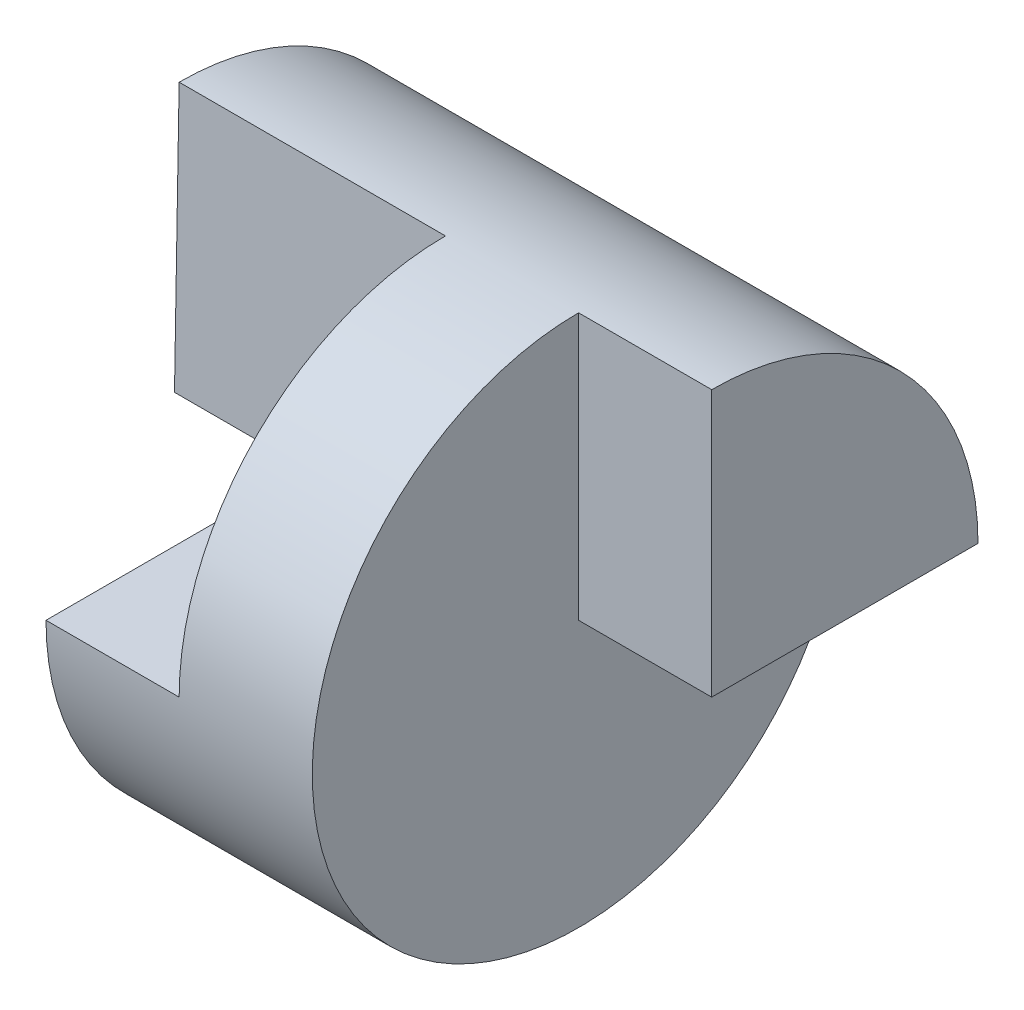
ISO-10303-21;
HEADER;
FILE_DESCRIPTION(('STEP AP214'),'2;1');
FILE_NAME('part.step','',(''),(''),'','','');
FILE_SCHEMA(('AUTOMOTIVE_DESIGN { 1 0 10303 214 1 1 1 1 }'));
ENDSEC;
DATA;
#1=APPLICATION_CONTEXT('core data for automotive mechanical design processes');
#2=APPLICATION_PROTOCOL_DEFINITION('international standard','automotive_design',2000,#1);
#3=PRODUCT_CONTEXT('',#1,'mechanical');
#4=PRODUCT('Part','Part','',(#3));
#5=PRODUCT_RELATED_PRODUCT_CATEGORY('part','',(#4));
#6=PRODUCT_DEFINITION_FORMATION('','',#4);
#7=PRODUCT_DEFINITION_CONTEXT('part definition',#1,'design');
#8=PRODUCT_DEFINITION('design','',#6,#7);
#9=PRODUCT_DEFINITION_SHAPE('','',#8);
#10=(LENGTH_UNIT() NAMED_UNIT(*) SI_UNIT(.MILLI.,.METRE.));
#11=(NAMED_UNIT(*) PLANE_ANGLE_UNIT() SI_UNIT($,.RADIAN.));
#12=(NAMED_UNIT(*) SI_UNIT($,.STERADIAN.) SOLID_ANGLE_UNIT());
#13=UNCERTAINTY_MEASURE_WITH_UNIT(LENGTH_MEASURE(1.E-05),#10,'distance_accuracy_value','');
#14=(GEOMETRIC_REPRESENTATION_CONTEXT(3) GLOBAL_UNCERTAINTY_ASSIGNED_CONTEXT((#13)) GLOBAL_UNIT_ASSIGNED_CONTEXT((#10,
#11,#12)) REPRESENTATION_CONTEXT('',''));
#15=CARTESIAN_POINT('',(0.,0.,0.));
#16=DIRECTION('',(0.,0.,1.));
#17=DIRECTION('',(1.,0.,0.));
#18=AXIS2_PLACEMENT_3D('',#15,#16,#17);
#19=CARTESIAN_POINT('',(0.,0.,0.));
#20=DIRECTION('',(-1.,0.,0.));
#21=DIRECTION('',(0.,0.,1.));
#22=AXIS2_PLACEMENT_3D('',#19,#20,#21);
#23=CYLINDRICAL_SURFACE('',#22,2.);
#24=DIRECTION('',(-1.,0.,0.));
#25=VECTOR('',#24,1.);
#26=CARTESIAN_POINT('',(0.,0.,-2.));
#27=LINE('',#26,#25);
#28=CARTESIAN_POINT('',(3.,0.,-2.));
#29=VERTEX_POINT('',#28);
#30=CARTESIAN_POINT('',(4.,0.,-2.));
#31=VERTEX_POINT('',#30);
#32=EDGE_CURVE('E94',#29,#31,#27,.F.);
#33=ORIENTED_EDGE('',*,*,#32,.F.);
#34=CARTESIAN_POINT('',(3.,0.,0.));
#35=DIRECTION('',(1.,0.,0.));
#36=DIRECTION('',(0.,0.,-1.));
#37=AXIS2_PLACEMENT_3D('',#34,#35,#36);
#38=CIRCLE('',#37,2.);
#39=CARTESIAN_POINT('',(3.,2.,0.));
#40=VERTEX_POINT('',#39);
#41=EDGE_CURVE('E11',#29,#40,#38,.F.);
#42=ORIENTED_EDGE('',*,*,#41,.T.);
#43=DIRECTION('',(-1.,0.,0.));
#44=VECTOR('',#43,1.);
#45=CARTESIAN_POINT('',(4.,2.,0.));
#46=LINE('',#45,#44);
#47=CARTESIAN_POINT('',(4.,2.,0.));
#48=VERTEX_POINT('',#47);
#49=EDGE_CURVE('E110',#48,#40,#46,.T.);
#50=ORIENTED_EDGE('',*,*,#49,.F.);
#51=CARTESIAN_POINT('',(4.,0.,0.));
#52=DIRECTION('',(-1.,0.,0.));
#53=DIRECTION('',(0.,0.,1.));
#54=AXIS2_PLACEMENT_3D('',#51,#52,#53);
#55=CIRCLE('',#54,2.);
#56=EDGE_CURVE('E106',#48,#31,#55,.T.);
#57=ORIENTED_EDGE('',*,*,#56,.T.);
#58=EDGE_LOOP('',(#33,#42,#50,#57));
#59=FACE_BOUND('',#58,.T.);
#60=DIRECTION('',(-1.,0.,0.));
#61=VECTOR('',#60,1.);
#62=CARTESIAN_POINT('',(0.,0.,-2.));
#63=LINE('',#62,#61);
#64=CARTESIAN_POINT('',(0.,0.,-2.));
#65=VERTEX_POINT('',#64);
#66=CARTESIAN_POINT('',(1.,0.,-2.));
#67=VERTEX_POINT('',#66);
#68=EDGE_CURVE('E146',#65,#67,#63,.F.);
#69=ORIENTED_EDGE('',*,*,#68,.F.);
#70=CARTESIAN_POINT('',(0.,0.,0.));
#71=DIRECTION('',(-1.,0.,0.));
#72=DIRECTION('',(0.,0.,1.));
#73=AXIS2_PLACEMENT_3D('',#70,#71,#72);
#74=CIRCLE('',#73,2.);
#75=CARTESIAN_POINT('',(0.,2.,0.));
#76=VERTEX_POINT('',#75);
#77=EDGE_CURVE('E111',#76,#65,#74,.T.);
#78=ORIENTED_EDGE('',*,*,#77,.F.);
#79=DIRECTION('',(1.,0.,0.));
#80=VECTOR('',#79,1.);
#81=CARTESIAN_POINT('',(0.5,2.,0.));
#82=LINE('',#81,#80);
#83=CARTESIAN_POINT('',(2.,2.,0.));
#84=VERTEX_POINT('',#83);
#85=EDGE_CURVE('E130',#76,#84,#82,.T.);
#86=ORIENTED_EDGE('',*,*,#85,.T.);
#87=CARTESIAN_POINT('',(2.,0.,0.));
#88=DIRECTION('',(1.,0.,0.));
#89=DIRECTION('',(0.,0.,-1.));
#90=AXIS2_PLACEMENT_3D('',#87,#88,#89);
#91=CIRCLE('',#90,2.);
#92=CARTESIAN_POINT('',(2.,0.,2.));
#93=VERTEX_POINT('',#92);
#94=EDGE_CURVE('E40',#93,#84,#91,.F.);
#95=ORIENTED_EDGE('',*,*,#94,.F.);
#96=DIRECTION('',(-1.,0.,0.));
#97=VECTOR('',#96,1.);
#98=CARTESIAN_POINT('',(0.,0.,2.));
#99=LINE('',#98,#97);
#100=CARTESIAN_POINT('',(1.,0.,2.));
#101=VERTEX_POINT('',#100);
#102=EDGE_CURVE('E112',#101,#93,#99,.F.);
#103=ORIENTED_EDGE('',*,*,#102,.F.);
#104=CARTESIAN_POINT('',(1.,0.,0.));
#105=DIRECTION('',(1.,0.,0.));
#106=DIRECTION('',(0.,0.,-1.));
#107=AXIS2_PLACEMENT_3D('',#104,#105,#106);
#108=CIRCLE('',#107,2.);
#109=EDGE_CURVE('E144',#67,#101,#108,.F.);
#110=ORIENTED_EDGE('',*,*,#109,.F.);
#111=EDGE_LOOP('',(#69,#78,#86,#95,#103,#110));
#112=FACE_BOUND('',#111,.T.);
#113=ADVANCED_FACE('F33',(#59,#112),#23,.T.);
#114=CARTESIAN_POINT('',(4.,0.,0.));
#115=DIRECTION('',(-1.,0.,0.));
#116=DIRECTION('',(0.,0.,1.));
#117=AXIS2_PLACEMENT_3D('',#114,#115,#116);
#118=PLANE('',#117);
#119=DIRECTION('',(0.,1.,0.));
#120=VECTOR('',#119,1.);
#121=CARTESIAN_POINT('',(4.,2.,0.));
#122=LINE('',#121,#120);
#123=CARTESIAN_POINT('',(4.,0.,0.));
#124=VERTEX_POINT('',#123);
#125=EDGE_CURVE('E100',#124,#48,#122,.T.);
#126=ORIENTED_EDGE('',*,*,#125,.F.);
#127=DIRECTION('',(0.,0.,1.));
#128=VECTOR('',#127,1.);
#129=CARTESIAN_POINT('',(4.,0.,-5.));
#130=LINE('',#129,#128);
#131=EDGE_CURVE('E47',#31,#124,#130,.T.);
#132=ORIENTED_EDGE('',*,*,#131,.F.);
#133=ORIENTED_EDGE('',*,*,#56,.F.);
#134=EDGE_LOOP('',(#126,#132,#133));
#135=FACE_BOUND('',#134,.T.);
#136=ADVANCED_FACE('F105',(#135),#118,.F.);
#137=CARTESIAN_POINT('',(0.,-2.,0.));
#138=DIRECTION('',(1.,0.,0.));
#139=DIRECTION('',(0.,0.,-1.));
#140=AXIS2_PLACEMENT_3D('',#137,#138,#139);
#141=PLANE('',#140);
#142=ORIENTED_EDGE('',*,*,#77,.T.);
#143=DIRECTION('',(0.,0.,-1.));
#144=VECTOR('',#143,1.);
#145=CARTESIAN_POINT('',(0.,0.,2.));
#146=LINE('',#145,#144);
#147=CARTESIAN_POINT('',(0.,0.,0.034977088325542));
#148=VERTEX_POINT('',#147);
#149=EDGE_CURVE('E148',#148,#65,#146,.T.);
#150=ORIENTED_EDGE('',*,*,#149,.F.);
#151=DIRECTION('',(0.,-0.99984711048149,0.017485870347671));
#152=VECTOR('',#151,1.);
#153=CARTESIAN_POINT('',(0.,0.,0.0349770883255419));
#154=LINE('',#153,#152);
#155=EDGE_CURVE('E142',#76,#148,#154,.T.);
#156=ORIENTED_EDGE('',*,*,#155,.F.);
#157=EDGE_LOOP('',(#142,#150,#156));
#158=FACE_BOUND('',#157,.T.);
#159=ADVANCED_FACE('F180',(#158),#141,.F.);
#160=CARTESIAN_POINT('',(0.,0.,-11.));
#161=DIRECTION('',(0.,-1.,0.));
#162=DIRECTION('',(1.,0.,0.));
#163=AXIS2_PLACEMENT_3D('',#160,#161,#162);
#164=PLANE('',#163);
#165=DIRECTION('',(1.,0.,0.));
#166=VECTOR('',#165,1.);
#167=CARTESIAN_POINT('',(0.,0.,0.0349770883255419));
#168=LINE('',#167,#166);
#169=CARTESIAN_POINT('',(1.,0.,0.0349770883255419));
#170=VERTEX_POINT('',#169);
#171=CARTESIAN_POINT('',(2.,0.,0.0349770883255419));
#172=VERTEX_POINT('',#171);
#173=EDGE_CURVE('E141',#170,#172,#168,.T.);
#174=ORIENTED_EDGE('',*,*,#173,.F.);
#175=DIRECTION('',(0.,0.,-1.));
#176=VECTOR('',#175,1.);
#177=CARTESIAN_POINT('',(1.,0.,2.));
#178=LINE('',#177,#176);
#179=EDGE_CURVE('E55',#101,#170,#178,.T.);
#180=ORIENTED_EDGE('',*,*,#179,.F.);
#181=ORIENTED_EDGE('',*,*,#102,.T.);
#182=DIRECTION('',(0.,0.,-1.));
#183=VECTOR('',#182,1.);
#184=CARTESIAN_POINT('',(2.,0.,10.));
#185=LINE('',#184,#183);
#186=EDGE_CURVE('E116',#93,#172,#185,.T.);
#187=ORIENTED_EDGE('',*,*,#186,.T.);
#188=EDGE_LOOP('',(#174,#180,#181,#187));
#189=FACE_BOUND('',#188,.T.);
#190=ADVANCED_FACE('F185',(#189),#164,.F.);
#191=CARTESIAN_POINT('',(2.,0.,10.));
#192=DIRECTION('',(1.,0.,0.));
#193=DIRECTION('',(0.,0.,-1.));
#194=AXIS2_PLACEMENT_3D('',#191,#192,#193);
#195=PLANE('',#194);
#196=ORIENTED_EDGE('',*,*,#94,.T.);
#197=DIRECTION('',(0.,-0.99984711048149,0.017485870347671));
#198=VECTOR('',#197,1.);
#199=CARTESIAN_POINT('',(2.,-0.174220458090097,0.0380239505009088));
#200=LINE('',#199,#198);
#201=EDGE_CURVE('E126',#84,#172,#200,.T.);
#202=ORIENTED_EDGE('',*,*,#201,.T.);
#203=ORIENTED_EDGE('',*,*,#186,.F.);
#204=EDGE_LOOP('',(#196,#202,#203));
#205=FACE_BOUND('',#204,.T.);
#206=ADVANCED_FACE('F125',(#205),#195,.F.);
#207=CARTESIAN_POINT('',(0.,0.,0.0349770883255419));
#208=DIRECTION('',(0.,0.017485870347671,0.99984711048149));
#209=DIRECTION('',(0.,-0.99984711048149,0.017485870347671));
#210=AXIS2_PLACEMENT_3D('',#207,#208,#209);
#211=PLANE('',#210);
#212=ORIENTED_EDGE('',*,*,#201,.F.);
#213=ORIENTED_EDGE('',*,*,#85,.F.);
#214=ORIENTED_EDGE('',*,*,#155,.T.);
#215=EDGE_CURVE('E136',#148,#170,#168,.T.);
#216=ORIENTED_EDGE('',*,*,#215,.T.);
#217=ORIENTED_EDGE('',*,*,#173,.T.);
#218=EDGE_LOOP('',(#212,#213,#214,#216,#217));
#219=FACE_BOUND('',#218,.T.);
#220=ADVANCED_FACE('F193',(#219),#211,.T.);
#221=CARTESIAN_POINT('',(1.,0.,2.));
#222=DIRECTION('',(0.,1.,0.));
#223=DIRECTION('',(0.,0.,1.));
#224=AXIS2_PLACEMENT_3D('',#221,#222,#223);
#225=PLANE('',#224);
#226=ORIENTED_EDGE('',*,*,#68,.T.);
#227=EDGE_CURVE('E150',#170,#67,#178,.T.);
#228=ORIENTED_EDGE('',*,*,#227,.F.);
#229=ORIENTED_EDGE('',*,*,#215,.F.);
#230=ORIENTED_EDGE('',*,*,#149,.T.);
#231=EDGE_LOOP('',(#226,#228,#229,#230));
#232=FACE_BOUND('',#231,.T.);
#233=ADVANCED_FACE('F196',(#232),#225,.F.);
#234=CARTESIAN_POINT('',(1.,0.,0.));
#235=DIRECTION('',(1.,0.,0.));
#236=DIRECTION('',(0.,0.,-1.));
#237=AXIS2_PLACEMENT_3D('',#234,#235,#236);
#238=PLANE('',#237);
#239=ORIENTED_EDGE('',*,*,#109,.T.);
#240=ORIENTED_EDGE('',*,*,#179,.T.);
#241=ORIENTED_EDGE('',*,*,#227,.T.);
#242=EDGE_LOOP('',(#239,#240,#241));
#243=FACE_BOUND('',#242,.T.);
#244=ADVANCED_FACE('F173',(#243),#238,.F.);
#245=CARTESIAN_POINT('',(3.,2.,10.));
#246=DIRECTION('',(1.,0.,0.));
#247=DIRECTION('',(0.,0.,-1.));
#248=AXIS2_PLACEMENT_3D('',#245,#246,#247);
#249=PLANE('',#248);
#250=ORIENTED_EDGE('',*,*,#41,.F.);
#251=DIRECTION('',(0.,0.,1.));
#252=VECTOR('',#251,1.);
#253=CARTESIAN_POINT('',(3.,0.,-5.));
#254=LINE('',#253,#252);
#255=CARTESIAN_POINT('',(3.,0.,0.));
#256=VERTEX_POINT('',#255);
#257=EDGE_CURVE('E97',#29,#256,#254,.T.);
#258=ORIENTED_EDGE('',*,*,#257,.T.);
#259=DIRECTION('',(0.,-1.,0.));
#260=VECTOR('',#259,1.);
#261=CARTESIAN_POINT('',(3.,2.,0.));
#262=LINE('',#261,#260);
#263=EDGE_CURVE('E154',#40,#256,#262,.T.);
#264=ORIENTED_EDGE('',*,*,#263,.F.);
#265=EDGE_LOOP('',(#250,#258,#264));
#266=FACE_BOUND('',#265,.T.);
#267=ADVANCED_FACE('F161',(#266),#249,.T.);
#268=CARTESIAN_POINT('',(0.,0.,0.));
#269=DIRECTION('',(0.,0.,-1.));
#270=DIRECTION('',(-1.,0.,0.));
#271=AXIS2_PLACEMENT_3D('',#268,#269,#270);
#272=PLANE('',#271);
#273=ORIENTED_EDGE('',*,*,#125,.T.);
#274=ORIENTED_EDGE('',*,*,#49,.T.);
#275=ORIENTED_EDGE('',*,*,#263,.T.);
#276=DIRECTION('',(1.,0.,0.));
#277=VECTOR('',#276,1.);
#278=CARTESIAN_POINT('',(4.,0.,0.));
#279=LINE('',#278,#277);
#280=EDGE_CURVE('E151',#256,#124,#279,.T.);
#281=ORIENTED_EDGE('',*,*,#280,.T.);
#282=EDGE_LOOP('',(#273,#274,#275,#281));
#283=FACE_BOUND('',#282,.T.);
#284=ADVANCED_FACE('F163',(#283),#272,.F.);
#285=CARTESIAN_POINT('',(3.,0.,-5.));
#286=DIRECTION('',(0.,1.,0.));
#287=DIRECTION('',(0.,0.,1.));
#288=AXIS2_PLACEMENT_3D('',#285,#286,#287);
#289=PLANE('',#288);
#290=ORIENTED_EDGE('',*,*,#32,.T.);
#291=ORIENTED_EDGE('',*,*,#131,.T.);
#292=ORIENTED_EDGE('',*,*,#280,.F.);
#293=ORIENTED_EDGE('',*,*,#257,.F.);
#294=EDGE_LOOP('',(#290,#291,#292,#293));
#295=FACE_BOUND('',#294,.T.);
#296=ADVANCED_FACE('F95',(#295),#289,.F.);
#297=CLOSED_SHELL('',(#113,#136,#159,#190,#206,#220,#233,#244,#267,#284,#296));
#298=MANIFOLD_SOLID_BREP('B2',#297);
#299=ADVANCED_BREP_SHAPE_REPRESENTATION('',(#18,#298),#14);
#300=SHAPE_DEFINITION_REPRESENTATION(#9,#299);
ENDSEC;
END-ISO-10303-21;
